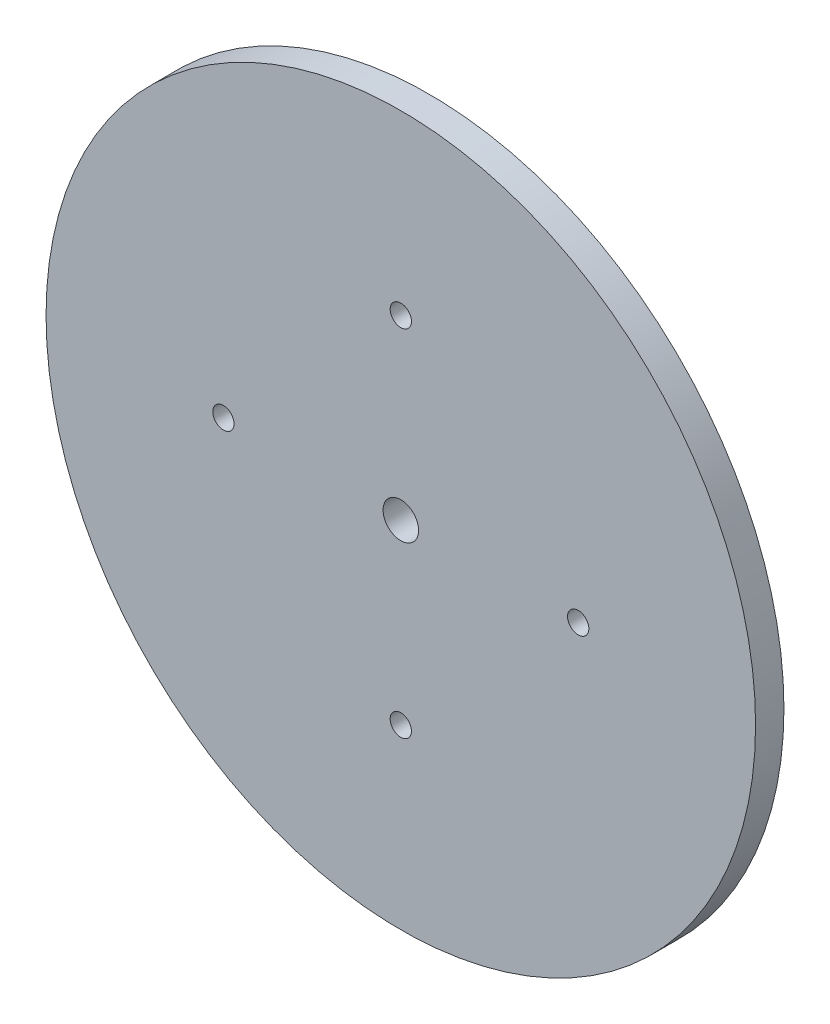
ISO-10303-21;
HEADER;
FILE_DESCRIPTION(('STEP AP214'),'2;1');
FILE_NAME('part.step','',(''),(''),'','','');
FILE_SCHEMA(('AUTOMOTIVE_DESIGN { 1 0 10303 214 1 1 1 1 }'));
ENDSEC;
DATA;
#1=APPLICATION_CONTEXT('core data for automotive mechanical design processes');
#2=APPLICATION_PROTOCOL_DEFINITION('international standard','automotive_design',2000,#1);
#3=PRODUCT_CONTEXT('',#1,'mechanical');
#4=PRODUCT('Part','Part','',(#3));
#5=PRODUCT_RELATED_PRODUCT_CATEGORY('part','',(#4));
#6=PRODUCT_DEFINITION_FORMATION('','',#4);
#7=PRODUCT_DEFINITION_CONTEXT('part definition',#1,'design');
#8=PRODUCT_DEFINITION('design','',#6,#7);
#9=PRODUCT_DEFINITION_SHAPE('','',#8);
#10=(LENGTH_UNIT() NAMED_UNIT(*) SI_UNIT(.MILLI.,.METRE.));
#11=(NAMED_UNIT(*) PLANE_ANGLE_UNIT() SI_UNIT($,.RADIAN.));
#12=(NAMED_UNIT(*) SI_UNIT($,.STERADIAN.) SOLID_ANGLE_UNIT());
#13=UNCERTAINTY_MEASURE_WITH_UNIT(LENGTH_MEASURE(1.E-05),#10,'distance_accuracy_value','');
#14=(GEOMETRIC_REPRESENTATION_CONTEXT(3) GLOBAL_UNCERTAINTY_ASSIGNED_CONTEXT((#13)) GLOBAL_UNIT_ASSIGNED_CONTEXT((#10,
#11,#12)) REPRESENTATION_CONTEXT('',''));
#15=CARTESIAN_POINT('',(0.,0.,0.));
#16=DIRECTION('',(0.,0.,1.));
#17=DIRECTION('',(1.,0.,0.));
#18=AXIS2_PLACEMENT_3D('',#15,#16,#17);
#19=CARTESIAN_POINT('',(-42.2867192924577,29.93899725906,4.));
#20=DIRECTION('',(0.,0.,-1.));
#21=DIRECTION('',(-1.,0.,0.));
#22=AXIS2_PLACEMENT_3D('',#19,#20,#21);
#23=CYLINDRICAL_SURFACE('',#22,50.);
#24=CARTESIAN_POINT('',(-42.2867192924577,29.93899725906,4.));
#25=DIRECTION('',(0.,0.,1.));
#26=DIRECTION('',(1.,0.,0.));
#27=AXIS2_PLACEMENT_3D('',#24,#25,#26);
#28=CIRCLE('',#27,50.);
#29=CARTESIAN_POINT('',(7.71328070754233,29.93899725906,4.));
#30=VERTEX_POINT('',#29);
#31=EDGE_CURVE('E10',#30,#30,#28,.T.);
#32=ORIENTED_EDGE('',*,*,#31,.F.);
#33=EDGE_LOOP('',(#32));
#34=FACE_BOUND('',#33,.T.);
#35=CARTESIAN_POINT('',(-42.2867192924577,29.93899725906,0.));
#36=DIRECTION('',(0.,0.,1.));
#37=DIRECTION('',(1.,0.,0.));
#38=AXIS2_PLACEMENT_3D('',#35,#36,#37);
#39=CIRCLE('',#38,50.);
#40=CARTESIAN_POINT('',(7.71328070754233,29.93899725906,0.));
#41=VERTEX_POINT('',#40);
#42=EDGE_CURVE('E38',#41,#41,#39,.T.);
#43=ORIENTED_EDGE('',*,*,#42,.T.);
#44=EDGE_LOOP('',(#43));
#45=FACE_BOUND('',#44,.T.);
#46=ADVANCED_FACE('F31',(#34,#45),#23,.T.);
#47=CARTESIAN_POINT('',(-42.2867192924577,29.93899725906,4.));
#48=DIRECTION('',(0.,0.,1.));
#49=DIRECTION('',(1.,0.,0.));
#50=AXIS2_PLACEMENT_3D('',#47,#48,#49);
#51=PLANE('',#50);
#52=CARTESIAN_POINT('',(-42.2867192924579,4.93899725906007,4.));
#53=DIRECTION('',(0.,0.,1.));
#54=DIRECTION('',(1.,0.,0.));
#55=AXIS2_PLACEMENT_3D('',#52,#53,#54);
#56=CIRCLE('',#55,1.49999999999999);
#57=CARTESIAN_POINT('',(-40.7867192924579,4.93899725906007,4.));
#58=VERTEX_POINT('',#57);
#59=EDGE_CURVE('E66',#58,#58,#56,.T.);
#60=ORIENTED_EDGE('',*,*,#59,.F.);
#61=EDGE_LOOP('',(#60));
#62=FACE_BOUND('',#61,.T.);
#63=CARTESIAN_POINT('',(-17.2867192924577,29.9389972590599,4.));
#64=DIRECTION('',(0.,0.,1.));
#65=DIRECTION('',(1.,0.,0.));
#66=AXIS2_PLACEMENT_3D('',#63,#64,#65);
#67=CIRCLE('',#66,1.5);
#68=CARTESIAN_POINT('',(-15.7867192924577,29.9389972590599,4.));
#69=VERTEX_POINT('',#68);
#70=EDGE_CURVE('E60',#69,#69,#67,.T.);
#71=ORIENTED_EDGE('',*,*,#70,.F.);
#72=EDGE_LOOP('',(#71));
#73=FACE_BOUND('',#72,.T.);
#74=CARTESIAN_POINT('',(-42.2867192924576,54.93899725906,4.));
#75=DIRECTION('',(0.,0.,1.));
#76=DIRECTION('',(1.,0.,0.));
#77=AXIS2_PLACEMENT_3D('',#74,#75,#76);
#78=CIRCLE('',#77,1.5);
#79=CARTESIAN_POINT('',(-40.7867192924576,54.93899725906,4.));
#80=VERTEX_POINT('',#79);
#81=EDGE_CURVE('E54',#80,#80,#78,.T.);
#82=ORIENTED_EDGE('',*,*,#81,.F.);
#83=EDGE_LOOP('',(#82));
#84=FACE_BOUND('',#83,.T.);
#85=CARTESIAN_POINT('',(-67.2867192924577,29.93899725906,4.));
#86=DIRECTION('',(0.,0.,1.));
#87=DIRECTION('',(1.,0.,0.));
#88=AXIS2_PLACEMENT_3D('',#85,#86,#87);
#89=CIRCLE('',#88,1.5);
#90=CARTESIAN_POINT('',(-65.7867192924577,29.93899725906,4.));
#91=VERTEX_POINT('',#90);
#92=EDGE_CURVE('E48',#91,#91,#89,.T.);
#93=ORIENTED_EDGE('',*,*,#92,.F.);
#94=EDGE_LOOP('',(#93));
#95=FACE_BOUND('',#94,.T.);
#96=CARTESIAN_POINT('',(-42.2867192924577,29.93899725906,4.));
#97=DIRECTION('',(0.,0.,1.));
#98=DIRECTION('',(1.,0.,0.));
#99=AXIS2_PLACEMENT_3D('',#96,#97,#98);
#100=CIRCLE('',#99,2.5);
#101=CARTESIAN_POINT('',(-39.7867192924577,29.93899725906,4.));
#102=VERTEX_POINT('',#101);
#103=EDGE_CURVE('E44',#102,#102,#100,.T.);
#104=ORIENTED_EDGE('',*,*,#103,.F.);
#105=EDGE_LOOP('',(#104));
#106=FACE_BOUND('',#105,.T.);
#107=ORIENTED_EDGE('',*,*,#31,.T.);
#108=EDGE_LOOP('',(#107));
#109=FACE_BOUND('',#108,.T.);
#110=ADVANCED_FACE('F82',(#62,#73,#84,#95,#106,#109),#51,.T.);
#111=CARTESIAN_POINT('',(-42.2867192924577,29.93899725906,0.));
#112=DIRECTION('',(0.,0.,1.));
#113=DIRECTION('',(1.,0.,0.));
#114=AXIS2_PLACEMENT_3D('',#111,#112,#113);
#115=PLANE('',#114);
#116=CARTESIAN_POINT('',(-42.2867192924579,4.93899725906007,0.));
#117=DIRECTION('',(0.,0.,1.));
#118=DIRECTION('',(1.,0.,0.));
#119=AXIS2_PLACEMENT_3D('',#116,#117,#118);
#120=CIRCLE('',#119,1.49999999999999);
#121=CARTESIAN_POINT('',(-40.7867192924579,4.93899725906007,0.));
#122=VERTEX_POINT('',#121);
#123=EDGE_CURVE('E63',#122,#122,#120,.T.);
#124=ORIENTED_EDGE('',*,*,#123,.T.);
#125=EDGE_LOOP('',(#124));
#126=FACE_BOUND('',#125,.T.);
#127=CARTESIAN_POINT('',(-17.2867192924577,29.9389972590599,0.));
#128=DIRECTION('',(0.,0.,1.));
#129=DIRECTION('',(1.,0.,0.));
#130=AXIS2_PLACEMENT_3D('',#127,#128,#129);
#131=CIRCLE('',#130,1.5);
#132=CARTESIAN_POINT('',(-15.7867192924577,29.9389972590599,0.));
#133=VERTEX_POINT('',#132);
#134=EDGE_CURVE('E57',#133,#133,#131,.T.);
#135=ORIENTED_EDGE('',*,*,#134,.T.);
#136=EDGE_LOOP('',(#135));
#137=FACE_BOUND('',#136,.T.);
#138=CARTESIAN_POINT('',(-42.2867192924576,54.93899725906,0.));
#139=DIRECTION('',(0.,0.,1.));
#140=DIRECTION('',(1.,0.,0.));
#141=AXIS2_PLACEMENT_3D('',#138,#139,#140);
#142=CIRCLE('',#141,1.5);
#143=CARTESIAN_POINT('',(-40.7867192924576,54.93899725906,0.));
#144=VERTEX_POINT('',#143);
#145=EDGE_CURVE('E51',#144,#144,#142,.T.);
#146=ORIENTED_EDGE('',*,*,#145,.T.);
#147=EDGE_LOOP('',(#146));
#148=FACE_BOUND('',#147,.T.);
#149=CARTESIAN_POINT('',(-67.2867192924577,29.93899725906,0.));
#150=DIRECTION('',(0.,0.,1.));
#151=DIRECTION('',(1.,0.,0.));
#152=AXIS2_PLACEMENT_3D('',#149,#150,#151);
#153=CIRCLE('',#152,1.5);
#154=CARTESIAN_POINT('',(-65.7867192924577,29.93899725906,0.));
#155=VERTEX_POINT('',#154);
#156=EDGE_CURVE('E47',#155,#155,#153,.T.);
#157=ORIENTED_EDGE('',*,*,#156,.T.);
#158=EDGE_LOOP('',(#157));
#159=FACE_BOUND('',#158,.T.);
#160=CARTESIAN_POINT('',(-42.2867192924577,29.93899725906,0.));
#161=DIRECTION('',(0.,0.,1.));
#162=DIRECTION('',(1.,0.,0.));
#163=AXIS2_PLACEMENT_3D('',#160,#161,#162);
#164=CIRCLE('',#163,2.5);
#165=CARTESIAN_POINT('',(-39.7867192924577,29.93899725906,0.));
#166=VERTEX_POINT('',#165);
#167=EDGE_CURVE('E34',#166,#166,#164,.T.);
#168=ORIENTED_EDGE('',*,*,#167,.T.);
#169=EDGE_LOOP('',(#168));
#170=FACE_BOUND('',#169,.T.);
#171=ORIENTED_EDGE('',*,*,#42,.F.);
#172=EDGE_LOOP('',(#171));
#173=FACE_BOUND('',#172,.T.);
#174=ADVANCED_FACE('F72',(#126,#137,#148,#159,#170,#173),#115,.F.);
#175=CARTESIAN_POINT('',(-42.2867192924577,29.93899725906,-1.));
#176=DIRECTION('',(0.,0.,1.));
#177=DIRECTION('',(1.,0.,0.));
#178=AXIS2_PLACEMENT_3D('',#175,#176,#177);
#179=CYLINDRICAL_SURFACE('',#178,2.5);
#180=ORIENTED_EDGE('',*,*,#103,.T.);
#181=EDGE_LOOP('',(#180));
#182=FACE_BOUND('',#181,.T.);
#183=ORIENTED_EDGE('',*,*,#167,.F.);
#184=EDGE_LOOP('',(#183));
#185=FACE_BOUND('',#184,.T.);
#186=ADVANCED_FACE('F94',(#182,#185),#179,.F.);
#187=CARTESIAN_POINT('',(-67.2867192924577,29.93899725906,0.));
#188=DIRECTION('',(0.,0.,1.));
#189=DIRECTION('',(1.,0.,0.));
#190=AXIS2_PLACEMENT_3D('',#187,#188,#189);
#191=CYLINDRICAL_SURFACE('',#190,1.5);
#192=ORIENTED_EDGE('',*,*,#156,.F.);
#193=EDGE_LOOP('',(#192));
#194=FACE_BOUND('',#193,.T.);
#195=ORIENTED_EDGE('',*,*,#92,.T.);
#196=EDGE_LOOP('',(#195));
#197=FACE_BOUND('',#196,.T.);
#198=ADVANCED_FACE('F97',(#194,#197),#191,.F.);
#199=CARTESIAN_POINT('',(-42.2867192924576,54.93899725906,0.));
#200=DIRECTION('',(0.,0.,1.));
#201=DIRECTION('',(1.,0.,0.));
#202=AXIS2_PLACEMENT_3D('',#199,#200,#201);
#203=CYLINDRICAL_SURFACE('',#202,1.5);
#204=ORIENTED_EDGE('',*,*,#145,.F.);
#205=EDGE_LOOP('',(#204));
#206=FACE_BOUND('',#205,.T.);
#207=ORIENTED_EDGE('',*,*,#81,.T.);
#208=EDGE_LOOP('',(#207));
#209=FACE_BOUND('',#208,.T.);
#210=ADVANCED_FACE('F128',(#206,#209),#203,.F.);
#211=CARTESIAN_POINT('',(-17.2867192924577,29.9389972590599,0.));
#212=DIRECTION('',(0.,0.,1.));
#213=DIRECTION('',(1.,0.,0.));
#214=AXIS2_PLACEMENT_3D('',#211,#212,#213);
#215=CYLINDRICAL_SURFACE('',#214,1.5);
#216=ORIENTED_EDGE('',*,*,#134,.F.);
#217=EDGE_LOOP('',(#216));
#218=FACE_BOUND('',#217,.T.);
#219=ORIENTED_EDGE('',*,*,#70,.T.);
#220=EDGE_LOOP('',(#219));
#221=FACE_BOUND('',#220,.T.);
#222=ADVANCED_FACE('F78',(#218,#221),#215,.F.);
#223=CARTESIAN_POINT('',(-42.2867192924579,4.93899725906007,0.));
#224=DIRECTION('',(0.,0.,1.));
#225=DIRECTION('',(1.,0.,0.));
#226=AXIS2_PLACEMENT_3D('',#223,#224,#225);
#227=CYLINDRICAL_SURFACE('',#226,1.49999999999999);
#228=ORIENTED_EDGE('',*,*,#123,.F.);
#229=EDGE_LOOP('',(#228));
#230=FACE_BOUND('',#229,.T.);
#231=ORIENTED_EDGE('',*,*,#59,.T.);
#232=EDGE_LOOP('',(#231));
#233=FACE_BOUND('',#232,.T.);
#234=ADVANCED_FACE('F75',(#230,#233),#227,.F.);
#235=CLOSED_SHELL('',(#46,#110,#174,#186,#198,#210,#222,#234));
#236=MANIFOLD_SOLID_BREP('B2',#235);
#237=ADVANCED_BREP_SHAPE_REPRESENTATION('',(#18,#236),#14);
#238=SHAPE_DEFINITION_REPRESENTATION(#9,#237);
ENDSEC;
END-ISO-10303-21;
